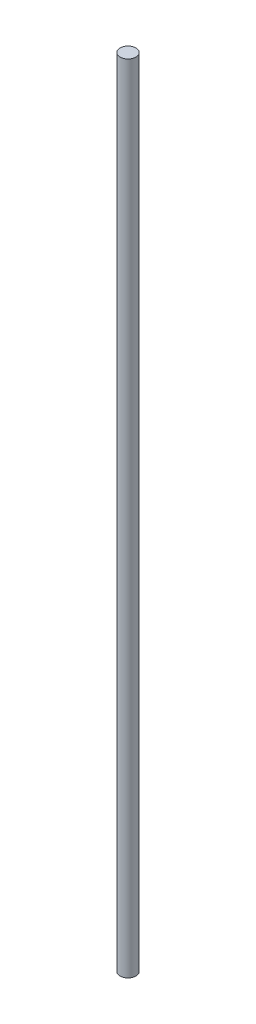
ISO-10303-21;
HEADER;
FILE_DESCRIPTION(('STEP AP214'),'2;1');
FILE_NAME('part.step','',(''),(''),'','','');
FILE_SCHEMA(('AUTOMOTIVE_DESIGN { 1 0 10303 214 1 1 1 1 }'));
ENDSEC;
DATA;
#1=APPLICATION_CONTEXT('core data for automotive mechanical design processes');
#2=APPLICATION_PROTOCOL_DEFINITION('international standard','automotive_design',2000,#1);
#3=PRODUCT_CONTEXT('',#1,'mechanical');
#4=PRODUCT('Part','Part','',(#3));
#5=PRODUCT_RELATED_PRODUCT_CATEGORY('part','',(#4));
#6=PRODUCT_DEFINITION_FORMATION('','',#4);
#7=PRODUCT_DEFINITION_CONTEXT('part definition',#1,'design');
#8=PRODUCT_DEFINITION('design','',#6,#7);
#9=PRODUCT_DEFINITION_SHAPE('','',#8);
#10=(LENGTH_UNIT() NAMED_UNIT(*) SI_UNIT(.MILLI.,.METRE.));
#11=(NAMED_UNIT(*) PLANE_ANGLE_UNIT() SI_UNIT($,.RADIAN.));
#12=(NAMED_UNIT(*) SI_UNIT($,.STERADIAN.) SOLID_ANGLE_UNIT());
#13=UNCERTAINTY_MEASURE_WITH_UNIT(LENGTH_MEASURE(1.E-05),#10,'distance_accuracy_value','');
#14=(GEOMETRIC_REPRESENTATION_CONTEXT(3) GLOBAL_UNCERTAINTY_ASSIGNED_CONTEXT((#13)) GLOBAL_UNIT_ASSIGNED_CONTEXT((#10,
#11,#12)) REPRESENTATION_CONTEXT('',''));
#15=CARTESIAN_POINT('',(0.,0.,0.));
#16=DIRECTION('',(0.,0.,1.));
#17=DIRECTION('',(1.,0.,0.));
#18=AXIS2_PLACEMENT_3D('',#15,#16,#17);
#19=CARTESIAN_POINT('',(0.,400.,0.));
#20=DIRECTION('',(0.,-1.,0.));
#21=DIRECTION('',(0.,0.,-1.));
#22=AXIS2_PLACEMENT_3D('',#19,#20,#21);
#23=CYLINDRICAL_SURFACE('',#22,4.);
#24=CARTESIAN_POINT('',(0.,400.,0.));
#25=DIRECTION('',(0.,1.,0.));
#26=DIRECTION('',(0.,0.,1.));
#27=AXIS2_PLACEMENT_3D('',#24,#25,#26);
#28=CIRCLE('',#27,4.);
#29=CARTESIAN_POINT('',(0.,400.,4.));
#30=VERTEX_POINT('',#29);
#31=EDGE_CURVE('E10',#30,#30,#28,.T.);
#32=ORIENTED_EDGE('',*,*,#31,.F.);
#33=EDGE_LOOP('',(#32));
#34=FACE_BOUND('',#33,.T.);
#35=CARTESIAN_POINT('',(0.,0.,0.));
#36=DIRECTION('',(0.,1.,0.));
#37=DIRECTION('',(0.,0.,1.));
#38=AXIS2_PLACEMENT_3D('',#35,#36,#37);
#39=CIRCLE('',#38,4.);
#40=CARTESIAN_POINT('',(0.,0.,4.));
#41=VERTEX_POINT('',#40);
#42=EDGE_CURVE('E37',#41,#41,#39,.T.);
#43=ORIENTED_EDGE('',*,*,#42,.T.);
#44=EDGE_LOOP('',(#43));
#45=FACE_BOUND('',#44,.T.);
#46=ADVANCED_FACE('F34',(#34,#45),#23,.T.);
#47=CARTESIAN_POINT('',(0.,400.,0.));
#48=DIRECTION('',(0.,1.,0.));
#49=DIRECTION('',(0.,0.,1.));
#50=AXIS2_PLACEMENT_3D('',#47,#48,#49);
#51=PLANE('',#50);
#52=ORIENTED_EDGE('',*,*,#31,.T.);
#53=EDGE_LOOP('',(#52));
#54=FACE_BOUND('',#53,.T.);
#55=ADVANCED_FACE('F51',(#54),#51,.T.);
#56=CARTESIAN_POINT('',(0.,0.,0.));
#57=DIRECTION('',(0.,1.,0.));
#58=DIRECTION('',(0.,0.,1.));
#59=AXIS2_PLACEMENT_3D('',#56,#57,#58);
#60=PLANE('',#59);
#61=ORIENTED_EDGE('',*,*,#42,.F.);
#62=EDGE_LOOP('',(#61));
#63=FACE_BOUND('',#62,.T.);
#64=ADVANCED_FACE('F49',(#63),#60,.F.);
#65=CLOSED_SHELL('',(#46,#55,#64));
#66=MANIFOLD_SOLID_BREP('B2',#65);
#67=ADVANCED_BREP_SHAPE_REPRESENTATION('',(#18,#66),#14);
#68=SHAPE_DEFINITION_REPRESENTATION(#9,#67);
ENDSEC;
END-ISO-10303-21;
